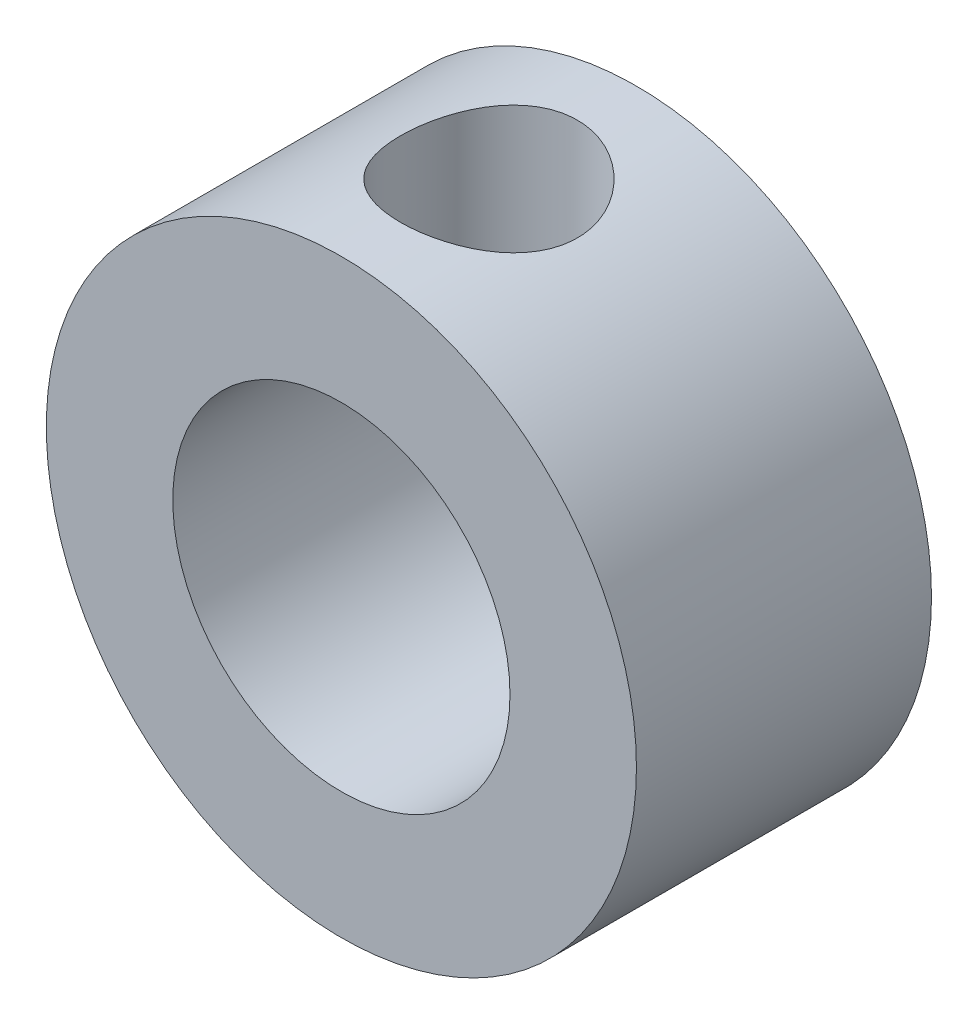
ISO-10303-21;
HEADER;
FILE_DESCRIPTION(('STEP AP214'),'2;1');
FILE_NAME('part.step','',(''),(''),'','','');
FILE_SCHEMA(('AUTOMOTIVE_DESIGN { 1 0 10303 214 1 1 1 1 }'));
ENDSEC;
DATA;
#1=APPLICATION_CONTEXT('core data for automotive mechanical design processes');
#2=APPLICATION_PROTOCOL_DEFINITION('international standard','automotive_design',2000,#1);
#3=PRODUCT_CONTEXT('',#1,'mechanical');
#4=PRODUCT('Part','Part','',(#3));
#5=PRODUCT_RELATED_PRODUCT_CATEGORY('part','',(#4));
#6=PRODUCT_DEFINITION_FORMATION('','',#4);
#7=PRODUCT_DEFINITION_CONTEXT('part definition',#1,'design');
#8=PRODUCT_DEFINITION('design','',#6,#7);
#9=PRODUCT_DEFINITION_SHAPE('','',#8);
#10=(LENGTH_UNIT() NAMED_UNIT(*) SI_UNIT(.MILLI.,.METRE.));
#11=(NAMED_UNIT(*) PLANE_ANGLE_UNIT() SI_UNIT($,.RADIAN.));
#12=(NAMED_UNIT(*) SI_UNIT($,.STERADIAN.) SOLID_ANGLE_UNIT());
#13=UNCERTAINTY_MEASURE_WITH_UNIT(LENGTH_MEASURE(1.E-05),#10,'distance_accuracy_value','');
#14=(GEOMETRIC_REPRESENTATION_CONTEXT(3) GLOBAL_UNCERTAINTY_ASSIGNED_CONTEXT((#13)) GLOBAL_UNIT_ASSIGNED_CONTEXT((#10,
#11,#12)) REPRESENTATION_CONTEXT('',''));
#15=CARTESIAN_POINT('',(0.,0.,0.));
#16=DIRECTION('',(0.,0.,1.));
#17=DIRECTION('',(1.,0.,0.));
#18=AXIS2_PLACEMENT_3D('',#15,#16,#17);
#19=CARTESIAN_POINT('',(0.,0.,7.));
#20=DIRECTION('',(0.,0.,1.));
#21=DIRECTION('',(1.,0.,0.));
#22=AXIS2_PLACEMENT_3D('',#19,#20,#21);
#23=PLANE('',#22);
#24=CARTESIAN_POINT('',(0.,0.,7.));
#25=DIRECTION('',(0.,0.,1.));
#26=DIRECTION('',(1.,0.,0.));
#27=AXIS2_PLACEMENT_3D('',#24,#25,#26);
#28=CIRCLE('',#27,7.);
#29=CARTESIAN_POINT('',(7.,0.,7.));
#30=VERTEX_POINT('',#29);
#31=EDGE_CURVE('E10',#30,#30,#28,.T.);
#32=ORIENTED_EDGE('',*,*,#31,.T.);
#33=EDGE_LOOP('',(#32));
#34=FACE_BOUND('',#33,.T.);
#35=CARTESIAN_POINT('',(0.,0.,7.));
#36=DIRECTION('',(0.,0.,1.));
#37=DIRECTION('',(1.,0.,0.));
#38=AXIS2_PLACEMENT_3D('',#35,#36,#37);
#39=CIRCLE('',#38,4.);
#40=CARTESIAN_POINT('',(4.,0.,7.));
#41=VERTEX_POINT('',#40);
#42=EDGE_CURVE('E46',#41,#41,#39,.T.);
#43=ORIENTED_EDGE('',*,*,#42,.F.);
#44=EDGE_LOOP('',(#43));
#45=FACE_BOUND('',#44,.T.);
#46=ADVANCED_FACE('F34',(#34,#45),#23,.T.);
#47=CARTESIAN_POINT('',(0.,0.,0.));
#48=DIRECTION('',(0.,0.,1.));
#49=DIRECTION('',(1.,0.,0.));
#50=AXIS2_PLACEMENT_3D('',#47,#48,#49);
#51=PLANE('',#50);
#52=CARTESIAN_POINT('',(0.,0.,0.));
#53=DIRECTION('',(0.,0.,1.));
#54=DIRECTION('',(1.,0.,0.));
#55=AXIS2_PLACEMENT_3D('',#52,#53,#54);
#56=CIRCLE('',#55,7.);
#57=CARTESIAN_POINT('',(7.,0.,0.));
#58=VERTEX_POINT('',#57);
#59=EDGE_CURVE('E39',#58,#58,#56,.T.);
#60=ORIENTED_EDGE('',*,*,#59,.F.);
#61=EDGE_LOOP('',(#60));
#62=FACE_BOUND('',#61,.T.);
#63=CARTESIAN_POINT('',(0.,0.,0.));
#64=DIRECTION('',(0.,0.,1.));
#65=DIRECTION('',(1.,0.,0.));
#66=AXIS2_PLACEMENT_3D('',#63,#64,#65);
#67=CIRCLE('',#66,4.);
#68=CARTESIAN_POINT('',(4.,0.,0.));
#69=VERTEX_POINT('',#68);
#70=EDGE_CURVE('E48',#69,#69,#67,.T.);
#71=ORIENTED_EDGE('',*,*,#70,.T.);
#72=EDGE_LOOP('',(#71));
#73=FACE_BOUND('',#72,.T.);
#74=ADVANCED_FACE('F75',(#62,#73),#51,.F.);
#75=CARTESIAN_POINT('',(0.,0.,7.));
#76=DIRECTION('',(0.,0.,-1.));
#77=DIRECTION('',(-1.,0.,0.));
#78=AXIS2_PLACEMENT_3D('',#75,#76,#77);
#79=CYLINDRICAL_SURFACE('',#78,7.);
#80=CARTESIAN_POINT('',(0.,7.,5.59999999999999));
#81=CARTESIAN_POINT('',(-0.115204057854619,6.9999990095077,5.59999860352115));
#82=CARTESIAN_POINT('',(-0.23042224569214,6.99712881971535,5.59048859092644));
#83=CARTESIAN_POINT('',(-0.457503375426832,6.98595947831167,5.55279010408905));
#84=CARTESIAN_POINT('',(-0.569365306175986,6.97765870745569,5.52459605876731));
#85=CARTESIAN_POINT('',(-0.786425790856335,6.95653773502571,5.45055557632562));
#86=CARTESIAN_POINT('',(-0.89163391015352,6.94372420350596,5.40473518253348));
#87=CARTESIAN_POINT('',(-1.09287385347438,6.91490952932704,5.29684946972182));
#88=CARTESIAN_POINT('',(-1.18890445445753,6.89890796268893,5.23478198964641));
#89=CARTESIAN_POINT('',(-1.37182051605724,6.86491032069884,5.09428638953826));
#90=CARTESIAN_POINT('',(-1.45840529974207,6.84687337119851,5.01547672375972));
#91=CARTESIAN_POINT('',(-1.61734889292653,6.81108167894619,4.84454707812574));
#92=CARTESIAN_POINT('',(-1.68970530858417,6.79332698414302,4.75242486302505));
#93=CARTESIAN_POINT('',(-1.8197205281319,6.75967759591281,4.55494094574734));
#94=CARTESIAN_POINT('',(-1.87701232631098,6.74383369329425,4.44932815461296));
#95=CARTESIAN_POINT('',(-1.97289952684664,6.71641068551644,4.22941504407759));
#96=CARTESIAN_POINT('',(-2.01149941887962,6.70483055638635,4.11511681850083));
#97=CARTESIAN_POINT('',(-2.06782287155712,6.68767219173808,3.88445362741736));
#98=CARTESIAN_POINT('',(-2.08610074728548,6.68193497054347,3.76823615859048));
#99=CARTESIAN_POINT('',(-2.1029922286054,6.67663905649674,3.53425358129653));
#100=CARTESIAN_POINT('',(-2.10161059865509,6.677078866648,3.41648885471728));
#101=CARTESIAN_POINT('',(-2.07965768079736,6.68394641694889,3.18726252794812));
#102=CARTESIAN_POINT('',(-2.05978087367759,6.69015744038797,3.07572684949287));
#103=CARTESIAN_POINT('',(-2.00252388597878,6.70751698720074,2.85765229921716));
#104=CARTESIAN_POINT('',(-1.96514197798297,6.71866599785291,2.75111392167594));
#105=CARTESIAN_POINT('',(-1.87342437315154,6.74481826304963,2.54435951047497));
#106=CARTESIAN_POINT('',(-1.81886343708499,6.75987222562333,2.44425008246264));
#107=CARTESIAN_POINT('',(-1.69449311624156,6.7921138180009,2.25437516918573));
#108=CARTESIAN_POINT('',(-1.62468003603623,6.80930196445788,2.16461219882071));
#109=CARTESIAN_POINT('',(-1.46833807071764,6.84475415817112,1.99403933293317));
#110=CARTESIAN_POINT('',(-1.38123287045376,6.86303316034697,1.91375987035847));
#111=CARTESIAN_POINT('',(-1.19456856303955,6.89797141688562,1.76882442231006));
#112=CARTESIAN_POINT('',(-1.09500867260524,6.91463056925774,1.70416942021981));
#113=CARTESIAN_POINT('',(-0.885297053679921,6.94460424097259,1.59199610854938));
#114=CARTESIAN_POINT('',(-0.775078849647127,6.9578956113564,1.5445954772502));
#115=CARTESIAN_POINT('',(-0.547743581844925,6.97946930565111,1.46916057386052));
#116=CARTESIAN_POINT('',(-0.430628452225412,6.98775302661799,1.44112090005452));
#117=CARTESIAN_POINT('',(-0.197333139735663,6.99815710500954,1.40608695094086));
#118=CARTESIAN_POINT('',(-0.0812701366416606,7.00048790584906,1.39837377987775));
#119=CARTESIAN_POINT('',(0.150499448152737,6.99934092538464,1.40219681799692));
#120=CARTESIAN_POINT('',(0.266206075367093,6.9958639194886,1.41373045751203));
#121=CARTESIAN_POINT('',(0.491265047433575,6.98362975782027,1.4551384555561));
#122=CARTESIAN_POINT('',(0.600701881659836,6.9749936171918,1.48459274261322));
#123=CARTESIAN_POINT('',(0.813056494536329,6.95344086978149,1.56050052588949));
#124=CARTESIAN_POINT('',(0.915973487835815,6.94052374849531,1.60695606545301));
#125=CARTESIAN_POINT('',(1.11501206524547,6.91137516091842,1.71675443167359));
#126=CARTESIAN_POINT('',(1.21092135667953,6.89507393161496,1.78046307732718));
#127=CARTESIAN_POINT('',(1.3909326311722,6.86102856270093,1.92251465567393));
#128=CARTESIAN_POINT('',(1.47503164529831,6.84328406203694,2.00086125664271));
#129=CARTESIAN_POINT('',(1.63220042371436,6.80754440616605,2.17334223171712));
#130=CARTESIAN_POINT('',(1.704758737241,6.78956355045859,2.26794662608056));
#131=CARTESIAN_POINT('',(1.83300593101018,6.75607121334564,2.46837911461882));
#132=CARTESIAN_POINT('',(1.88869525361275,6.74055966719185,2.57420691438104));
#133=CARTESIAN_POINT('',(1.9812428597802,6.71394065458417,2.79374548775703));
#134=CARTESIAN_POINT('',(2.01818885711814,6.70281272971451,2.90741666115297));
#135=CARTESIAN_POINT('',(2.07230423141214,6.68628232117816,3.13976315650233));
#136=CARTESIAN_POINT('',(2.08948038570493,6.68087787548571,3.25843674909625));
#137=CARTESIAN_POINT('',(2.1031077827895,6.67659961459091,3.49210612574379));
#138=CARTESIAN_POINT('',(2.1003927743112,6.67746306290276,3.60704911146919));
#139=CARTESIAN_POINT('',(2.07630507622027,6.68499161674532,3.83475974476086));
#140=CARTESIAN_POINT('',(2.05493313374585,6.69165648995131,3.94752747925272));
#141=CARTESIAN_POINT('',(1.9946764432608,6.7098606917247,4.16632355878434));
#142=CARTESIAN_POINT('',(1.95601245709973,6.72133846373454,4.27241820230217));
#143=CARTESIAN_POINT('',(1.86244109969503,6.74786390463686,4.47669941434901));
#144=CARTESIAN_POINT('',(1.80753061948005,6.76291225669556,4.5748844646982));
#145=CARTESIAN_POINT('',(1.68068269327122,6.79556746998737,4.76442836313677));
#146=CARTESIAN_POINT('',(1.60819786530197,6.81324756230006,4.85540826576426));
#147=CARTESIAN_POINT('',(1.44924408481688,6.84881848629347,5.02418349763132));
#148=CARTESIAN_POINT('',(1.36277150398828,6.8667093715328,5.10197539525494));
#149=CARTESIAN_POINT('',(1.17525206705656,6.90131311199101,5.24443277721295));
#150=CARTESIAN_POINT('',(1.07385304010685,6.91797623671995,5.30864802559766));
#151=CARTESIAN_POINT('',(0.861197923576932,6.94764952638087,5.41902923786565));
#152=CARTESIAN_POINT('',(0.749946474198531,6.9606613990348,5.46520364358431));
#153=CARTESIAN_POINT('',(0.533060797717391,6.98043044957033,5.53405338591384));
#154=CARTESIAN_POINT('',(0.428101746735925,6.98770838333498,5.55871634203654));
#155=CARTESIAN_POINT('',(0.215432273323089,6.99749322292286,5.5916889353382));
#156=CARTESIAN_POINT('',(0.107722313801395,7.00000092616635,5.60000130578674));
#157=CARTESIAN_POINT('',(0.,7.,5.59999999999999));
#158=B_SPLINE_CURVE_WITH_KNOTS('',3,(#80,#81,#82,#83,#84,#85,#86,#87,#88,#89,#90,#91,#92,#93,
#94,#95,#96,#97,#98,#99,#100,#101,#102,#103,#104,#105,#106,#107,#108,#109,#110,#111,#112,#113,
#114,#115,#116,#117,#118,#119,#120,#121,#122,#123,#124,#125,#126,#127,#128,#129,#130,#131,#132,
#133,#134,#135,#136,#137,#138,#139,#140,#141,#142,#143,#144,#145,#146,#147,#148,#149,#150,#151,
#152,#153,#154,#155,#156,#157),.UNSPECIFIED.,.T.,.F.,(4,2,2,2,2,2,2,2,2,2,2,2,2,2,2,2,2,2,2,2,2,
2,2,2,2,2,2,2,2,2,2,2,2,2,2,2,2,2,4),(0.,0.345216485057654,0.690535950784397,1.03534714682122,
1.38020423017778,1.73397844127468,2.08781212204086,2.44960073405752,2.81130240360512,
3.16287565099237,3.51436369646724,3.85316423376745,4.191998211212,4.53547397025966,
4.87903304221976,5.23693945667431,5.59486839143498,5.95519465634362,6.31542034940329,
6.66272333213961,7.00997994970455,7.34939445355255,7.68884976431217,8.03615827984069,
8.38355394800265,8.74356560451943,9.1035678195375,9.46186940931749,9.82004813244393,
10.1633021765698,10.5065424753262,10.8455205657019,11.1845635658073,11.5359569595828,
11.8874416486288,12.2492019462572,12.6107927623971,12.9336436870902,13.256440637348),.UNSPECIFIED.);
#159=CARTESIAN_POINT('',(0.,7.,5.59999999999999));
#160=VERTEX_POINT('',#159);
#161=EDGE_CURVE('E51',#160,#160,#158,.T.);
#162=ORIENTED_EDGE('',*,*,#161,.T.);
#163=EDGE_LOOP('',(#162));
#164=FACE_BOUND('',#163,.T.);
#165=ORIENTED_EDGE('',*,*,#31,.F.);
#166=EDGE_LOOP('',(#165));
#167=FACE_BOUND('',#166,.T.);
#168=ORIENTED_EDGE('',*,*,#59,.T.);
#169=EDGE_LOOP('',(#168));
#170=FACE_BOUND('',#169,.T.);
#171=ADVANCED_FACE('F36',(#164,#167,#170),#79,.T.);
#172=CARTESIAN_POINT('',(0.,0.,7.));
#173=DIRECTION('',(0.,0.,-1.));
#174=DIRECTION('',(-1.,0.,0.));
#175=AXIS2_PLACEMENT_3D('',#172,#173,#174);
#176=CYLINDRICAL_SURFACE('',#175,4.);
#177=CARTESIAN_POINT('',(0.,4.,5.59999999999999));
#178=CARTESIAN_POINT('',(-0.109725239522176,3.99999264287857,5.59999149182402));
#179=CARTESIAN_POINT('',(-0.219566121797986,3.99543735627817,5.59134922217853));
#180=CARTESIAN_POINT('',(-0.435956332853302,3.97766056559727,5.55717948516371));
#181=CARTESIAN_POINT('',(-0.542499967026169,3.96442485872988,5.53162434455592));
#182=CARTESIAN_POINT('',(-0.748847767256636,3.93066356262107,5.46492682041998));
#183=CARTESIAN_POINT('',(-0.848677088492019,3.91016722161181,5.42384693196482));
#184=CARTESIAN_POINT('',(-1.0398542926017,3.86372814833453,5.32761268027));
#185=CARTESIAN_POINT('',(-1.13120230734359,3.83778550076629,5.27245853590725));
#186=CARTESIAN_POINT('',(-1.30947182891695,3.78081963010103,5.14560480379001));
#187=CARTESIAN_POINT('',(-1.39572427915895,3.7495762633363,5.07306544943579));
#188=CARTESIAN_POINT('',(-1.55546505007128,3.68618069665244,4.91532568390628));
#189=CARTESIAN_POINT('',(-1.62894256542358,3.65402775386038,4.83011466668523));
#190=CARTESIAN_POINT('',(-1.76753210720386,3.58917602274785,4.64052416418153));
#191=CARTESIAN_POINT('',(-1.83134596949795,3.55667651133239,4.53511911137416));
#192=CARTESIAN_POINT('',(-1.940078009522,3.49855992208216,4.31322101259495));
#193=CARTESIAN_POINT('',(-1.98501055983617,3.47293761465966,4.19673648353417));
#194=CARTESIAN_POINT('',(-2.05162778973322,3.43398312295477,3.9632691019904));
#195=CARTESIAN_POINT('',(-2.07458133375183,3.41998733122417,3.84676509569801));
#196=CARTESIAN_POINT('',(-2.10042065774089,3.40418721984817,3.61079196134464));
#197=CARTESIAN_POINT('',(-2.10333025607271,3.40236843025802,3.49132652193647));
#198=CARTESIAN_POINT('',(-2.08992575686747,3.41060563138389,3.27023585900601));
#199=CARTESIAN_POINT('',(-2.07615752002025,3.4190893964975,3.16838235315366));
#200=CARTESIAN_POINT('',(-2.03424482005422,3.44418916575293,2.96871985136041));
#201=CARTESIAN_POINT('',(-2.00609491145431,3.46080825015501,2.87091240259461));
#202=CARTESIAN_POINT('',(-1.93576201725034,3.50064017337879,2.67933944133553));
#203=CARTESIAN_POINT('',(-1.89327386515966,3.52399463994301,2.58571682638858));
#204=CARTESIAN_POINT('',(-1.79571666755297,3.57469177714186,2.40646125445991));
#205=CARTESIAN_POINT('',(-1.74064200304352,3.60203622704668,2.32083189002303));
#206=CARTESIAN_POINT('',(-1.61039398180521,3.66230444404028,2.14721957759017));
#207=CARTESIAN_POINT('',(-1.53347842501707,3.69546972830905,2.0606227305343));
#208=CARTESIAN_POINT('',(-1.36616462781175,3.76053926987168,1.90094507949335));
#209=CARTESIAN_POINT('',(-1.27575868558247,3.79244279356364,1.82787205014572));
#210=CARTESIAN_POINT('',(-1.07766804032998,3.85356353260701,1.69341787931535));
#211=CARTESIAN_POINT('',(-0.969298919443496,3.88252998474475,1.63292153118831));
#212=CARTESIAN_POINT('',(-0.742023442184859,3.93228772595726,1.53153732928501));
#213=CARTESIAN_POINT('',(-0.623126340783865,3.95308610970455,1.4906324518135));
#214=CARTESIAN_POINT('',(-0.389396974626688,3.9825873442618,1.43322732089386));
#215=CARTESIAN_POINT('',(-0.275130823094222,3.99219507728301,1.4148930907168));
#216=CARTESIAN_POINT('',(-0.0447608666750918,4.00140669767392,1.39730685099086));
#217=CARTESIAN_POINT('',(0.0713418920739022,4.00101608864393,1.39804434338993));
#218=CARTESIAN_POINT('',(0.291279078552977,3.99076728683619,1.41762725788288));
#219=CARTESIAN_POINT('',(0.395299675486035,3.98173859499713,1.43488622954968));
#220=CARTESIAN_POINT('',(0.59872818219623,3.95626547527309,1.4844387504391));
#221=CARTESIAN_POINT('',(0.69813560404272,3.93982026491349,1.51673388605335));
#222=CARTESIAN_POINT('',(0.892553327327724,3.90044221082327,1.59614425381874));
#223=CARTESIAN_POINT('',(0.987382033379108,3.87735176388228,1.64362307426732));
#224=CARTESIAN_POINT('',(1.16801156602731,3.82682103032807,1.75161917503483));
#225=CARTESIAN_POINT('',(1.25380875133066,3.79937900035166,1.81214168451701));
#226=CARTESIAN_POINT('',(1.42355402164766,3.73930849945052,1.95183455389138));
#227=CARTESIAN_POINT('',(1.50635375236175,3.70643824529688,2.03229813881506));
#228=CARTESIAN_POINT('',(1.65784945462857,3.64120206418591,2.20585137885724));
#229=CARTESIAN_POINT('',(1.72653319455466,3.60883659688132,2.298951868959));
#230=CARTESIAN_POINT('',(1.85197407713202,3.54618291275876,2.50233559015912));
#231=CARTESIAN_POINT('',(1.907720584217,3.51615003477916,2.61332823562711));
#232=CARTESIAN_POINT('',(1.99916377433975,3.46498558301669,2.84516122596434));
#233=CARTESIAN_POINT('',(2.03488847416354,3.44384158132139,2.96598753776114));
#234=CARTESIAN_POINT('',(2.08179228794019,3.41567335738197,3.20149049526115));
#235=CARTESIAN_POINT('',(2.09503212797938,3.4074693970288,3.31561103123257));
#236=CARTESIAN_POINT('',(2.10264402498694,3.40278132518373,3.54469308443814));
#237=CARTESIAN_POINT('',(2.09702755352025,3.40629008804561,3.6596540479175));
#238=CARTESIAN_POINT('',(2.06905731966412,3.42333280060867,3.87316961432223));
#239=CARTESIAN_POINT('',(2.04869586578453,3.4356715106149,3.97209433551285));
#240=CARTESIAN_POINT('',(1.99445953447468,3.4674360798436,4.16496081401225));
#241=CARTESIAN_POINT('',(1.96057985676336,3.48686445637592,4.25890078781238));
#242=CARTESIAN_POINT('',(1.8778270800915,3.53215539501753,4.44599660125697));
#243=CARTESIAN_POINT('',(1.82811697206111,3.55835615136984,4.53869769157733));
#244=CARTESIAN_POINT('',(1.71597189148521,3.61377283019222,4.71506230921822));
#245=CARTESIAN_POINT('',(1.65353007488422,3.64299037017672,4.79872093850826));
#246=CARTESIAN_POINT('',(1.50756499361577,3.7059946066124,4.96672364713411));
#247=CARTESIAN_POINT('',(1.42231898680451,3.73985298438168,5.04955350976633));
#248=CARTESIAN_POINT('',(1.2383912708079,3.80472261290781,5.20015739194561));
#249=CARTESIAN_POINT('',(1.13970134446325,3.83573210281286,5.26792213623382));
#250=CARTESIAN_POINT('',(0.928722586410789,3.89224463430732,5.38743364904117));
#251=CARTESIAN_POINT('',(0.816206474636302,3.91762876470986,5.43884301060635));
#252=CARTESIAN_POINT('',(0.641101799511677,3.94873745727715,5.50070791315573));
#253=CARTESIAN_POINT('',(0.581718321049471,3.95794212176884,5.51878135698884));
#254=CARTESIAN_POINT('',(0.461272845180562,3.97377707651405,5.54965439112677));
#255=CARTESIAN_POINT('',(0.400211824286285,3.98040883184999,5.56245698304871));
#256=CARTESIAN_POINT('',(0.282777177199966,3.99038534961525,5.58164251076547));
#257=CARTESIAN_POINT('',(0.226504746010371,3.99398117175069,5.58851710911177));
#258=CARTESIAN_POINT('',(0.113498532604898,3.99879042332403,5.59769809925702));
#259=CARTESIAN_POINT('',(0.0567647413745303,4.00000380609873,5.60000440157989));
#260=CARTESIAN_POINT('',(0.,4.,5.59999999999999));
#261=B_SPLINE_CURVE_WITH_KNOTS('',3,(#177,#178,#179,#180,#181,#182,#183,#184,#185,#186,#187,
#188,#189,#190,#191,#192,#193,#194,#195,#196,#197,#198,#199,#200,#201,#202,#203,#204,#205,#206,
#207,#208,#209,#210,#211,#212,#213,#214,#215,#216,#217,#218,#219,#220,#221,#222,#223,#224,#225,
#226,#227,#228,#229,#230,#231,#232,#233,#234,#235,#236,#237,#238,#239,#240,#241,#242,#243,#244,
#245,#246,#247,#248,#249,#250,#251,#252,#253,#254,#255,#256,#257,#258,#259,#260),.UNSPECIFIED.,
.T.,.F.,(4,2,2,2,2,2,2,2,2,2,2,2,2,2,2,2,2,2,2,2,2,2,2,2,2,2,2,2,2,2,2,2,2,2,2,2,2,2,2,2,2,4),
(0.,0.328955388056857,0.658450355809532,0.986632826787795,1.31481019432104,1.66422610127769,
2.01393612903032,2.3943054227538,2.77438464995627,3.13089429519634,3.48698022433371,
3.79492330354658,4.1029830689429,4.41806287071791,4.73328360921355,5.09317488258759,
5.45327241364169,5.83355153918035,6.21349962504737,6.55994297045683,6.90619561978192,
7.2222202700175,7.53827827001647,7.8625561182731,8.18696421086292,8.54557019619713,
8.90448561862084,9.28577946390599,9.66653841880975,10.0100186118085,10.3532898805347,
10.6572136356427,10.9612454093543,11.2851996834104,11.6093285635883,11.9784125341219,
12.347723115996,12.7242211787441,12.9122308814786,13.1001333688401,13.2703102751049,
13.4404905144748),.UNSPECIFIED.);
#262=CARTESIAN_POINT('',(0.,4.,5.59999999999999));
#263=VERTEX_POINT('',#262);
#264=EDGE_CURVE('E59',#263,#263,#261,.T.);
#265=ORIENTED_EDGE('',*,*,#264,.F.);
#266=EDGE_LOOP('',(#265));
#267=FACE_BOUND('',#266,.T.);
#268=ORIENTED_EDGE('',*,*,#42,.T.);
#269=EDGE_LOOP('',(#268));
#270=FACE_BOUND('',#269,.T.);
#271=ORIENTED_EDGE('',*,*,#70,.F.);
#272=EDGE_LOOP('',(#271));
#273=FACE_BOUND('',#272,.T.);
#274=ADVANCED_FACE('F66',(#267,#270,#273),#176,.F.);
#275=CARTESIAN_POINT('',(0.,7.,3.5));
#276=DIRECTION('',(0.,1.,0.));
#277=DIRECTION('',(0.,0.,1.));
#278=AXIS2_PLACEMENT_3D('',#275,#276,#277);
#279=CYLINDRICAL_SURFACE('',#278,2.09999999999999);
#280=ORIENTED_EDGE('',*,*,#264,.T.);
#281=EDGE_LOOP('',(#280));
#282=FACE_BOUND('',#281,.T.);
#283=ORIENTED_EDGE('',*,*,#161,.F.);
#284=EDGE_LOOP('',(#283));
#285=FACE_BOUND('',#284,.T.);
#286=ADVANCED_FACE('F63',(#282,#285),#279,.F.);
#287=CLOSED_SHELL('',(#46,#74,#171,#274,#286));
#288=MANIFOLD_SOLID_BREP('B2',#287);
#289=ADVANCED_BREP_SHAPE_REPRESENTATION('',(#18,#288),#14);
#290=SHAPE_DEFINITION_REPRESENTATION(#9,#289);
ENDSEC;
END-ISO-10303-21;
